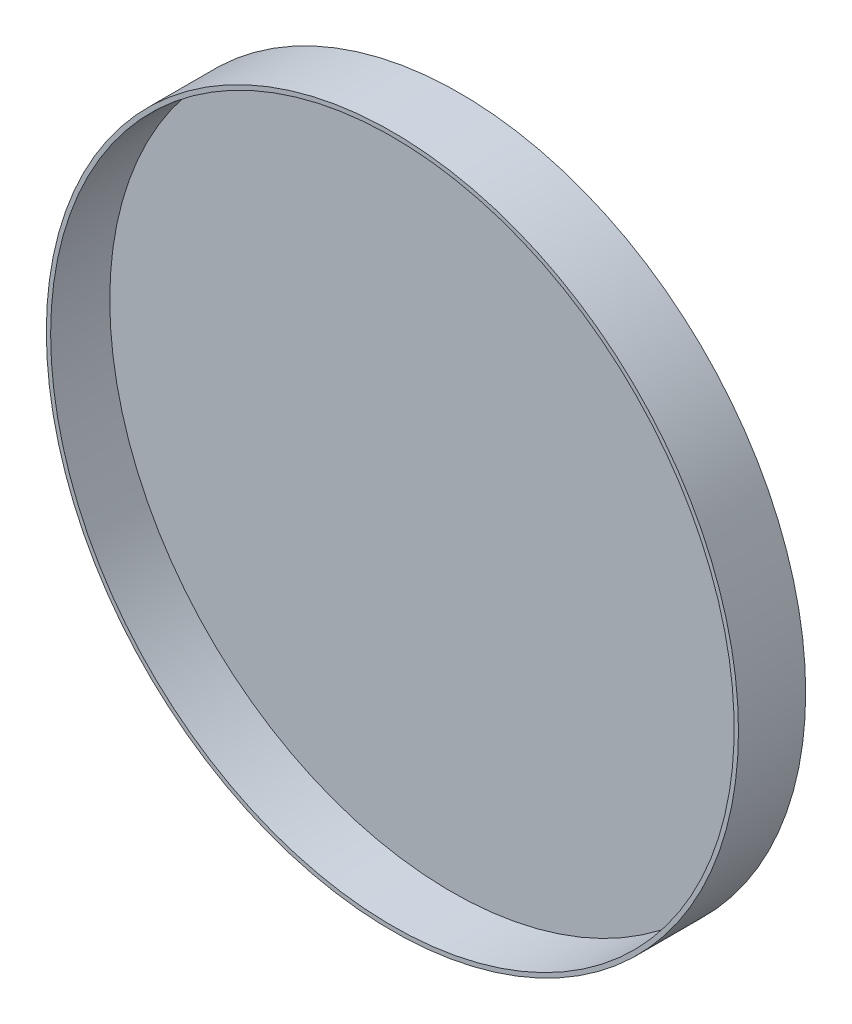
ISO-10303-21;
HEADER;
FILE_DESCRIPTION(('STEP AP214'),'2;1');
FILE_NAME('part.step','',(''),(''),'','','');
FILE_SCHEMA(('AUTOMOTIVE_DESIGN { 1 0 10303 214 1 1 1 1 }'));
ENDSEC;
DATA;
#1=APPLICATION_CONTEXT('core data for automotive mechanical design processes');
#2=APPLICATION_PROTOCOL_DEFINITION('international standard','automotive_design',2000,#1);
#3=PRODUCT_CONTEXT('',#1,'mechanical');
#4=PRODUCT('Part','Part','',(#3));
#5=PRODUCT_RELATED_PRODUCT_CATEGORY('part','',(#4));
#6=PRODUCT_DEFINITION_FORMATION('','',#4);
#7=PRODUCT_DEFINITION_CONTEXT('part definition',#1,'design');
#8=PRODUCT_DEFINITION('design','',#6,#7);
#9=PRODUCT_DEFINITION_SHAPE('','',#8);
#10=(LENGTH_UNIT() NAMED_UNIT(*) SI_UNIT(.MILLI.,.METRE.));
#11=(NAMED_UNIT(*) PLANE_ANGLE_UNIT() SI_UNIT($,.RADIAN.));
#12=(NAMED_UNIT(*) SI_UNIT($,.STERADIAN.) SOLID_ANGLE_UNIT());
#13=UNCERTAINTY_MEASURE_WITH_UNIT(LENGTH_MEASURE(1.E-05),#10,'distance_accuracy_value','');
#14=(GEOMETRIC_REPRESENTATION_CONTEXT(3) GLOBAL_UNCERTAINTY_ASSIGNED_CONTEXT((#13)) GLOBAL_UNIT_ASSIGNED_CONTEXT((#10,
#11,#12)) REPRESENTATION_CONTEXT('',''));
#15=CARTESIAN_POINT('',(0.,0.,0.));
#16=DIRECTION('',(0.,0.,1.));
#17=DIRECTION('',(1.,0.,0.));
#18=AXIS2_PLACEMENT_3D('',#15,#16,#17);
#19=CARTESIAN_POINT('',(0.,0.,0.));
#20=DIRECTION('',(0.,0.,-1.));
#21=DIRECTION('',(-1.,0.,0.));
#22=AXIS2_PLACEMENT_3D('',#19,#20,#21);
#23=PLANE('',#22);
#24=CARTESIAN_POINT('',(0.,0.,0.));
#25=DIRECTION('',(0.,0.,-1.));
#26=DIRECTION('',(-1.,0.,0.));
#27=AXIS2_PLACEMENT_3D('',#24,#25,#26);
#28=CIRCLE('',#27,32.2961);
#29=CARTESIAN_POINT('',(-32.2961,0.,0.));
#30=VERTEX_POINT('',#29);
#31=EDGE_CURVE('E15',#30,#30,#28,.F.);
#32=ORIENTED_EDGE('',*,*,#31,.T.);
#33=EDGE_LOOP('',(#32));
#34=FACE_BOUND('',#33,.T.);
#35=ADVANCED_FACE('F12',(#34),#23,.F.);
#36=CARTESIAN_POINT('',(0.,0.,5.588));
#37=DIRECTION('',(0.,0.,-1.));
#38=DIRECTION('',(-1.,0.,0.));
#39=AXIS2_PLACEMENT_3D('',#36,#37,#38);
#40=CYLINDRICAL_SURFACE('',#39,32.2961);
#41=CARTESIAN_POINT('',(0.,0.,5.588));
#42=DIRECTION('',(0.,0.,-1.));
#43=DIRECTION('',(-1.,0.,0.));
#44=AXIS2_PLACEMENT_3D('',#41,#42,#43);
#45=CIRCLE('',#44,32.2961);
#46=CARTESIAN_POINT('',(-32.2961,0.,5.588));
#47=VERTEX_POINT('',#46);
#48=EDGE_CURVE('E24',#47,#47,#45,.T.);
#49=ORIENTED_EDGE('',*,*,#48,.F.);
#50=EDGE_LOOP('',(#49));
#51=FACE_BOUND('',#50,.T.);
#52=ORIENTED_EDGE('',*,*,#31,.F.);
#53=EDGE_LOOP('',(#52));
#54=FACE_BOUND('',#53,.T.);
#55=ADVANCED_FACE('F33',(#51,#54),#40,.F.);
#56=CARTESIAN_POINT('',(0.,0.,5.588));
#57=DIRECTION('',(0.,0.,1.));
#58=DIRECTION('',(1.,0.,0.));
#59=AXIS2_PLACEMENT_3D('',#56,#57,#58);
#60=PLANE('',#59);
#61=ORIENTED_EDGE('',*,*,#48,.T.);
#62=EDGE_LOOP('',(#61));
#63=FACE_BOUND('',#62,.T.);
#64=CARTESIAN_POINT('',(0.,0.,5.588));
#65=DIRECTION('',(0.,0.,-1.));
#66=DIRECTION('',(-1.,0.,0.));
#67=AXIS2_PLACEMENT_3D('',#64,#65,#66);
#68=CIRCLE('',#67,32.7025);
#69=CARTESIAN_POINT('',(-32.7025,0.,5.588));
#70=VERTEX_POINT('',#69);
#71=EDGE_CURVE('E19',#70,#70,#68,.T.);
#72=ORIENTED_EDGE('',*,*,#71,.F.);
#73=EDGE_LOOP('',(#72));
#74=FACE_BOUND('',#73,.T.);
#75=ADVANCED_FACE('F35',(#63,#74),#60,.T.);
#76=CARTESIAN_POINT('',(0.,0.,5.588));
#77=DIRECTION('',(0.,0.,-1.));
#78=DIRECTION('',(-1.,0.,0.));
#79=AXIS2_PLACEMENT_3D('',#76,#77,#78);
#80=CYLINDRICAL_SURFACE('',#79,32.7025);
#81=ORIENTED_EDGE('',*,*,#71,.T.);
#82=EDGE_LOOP('',(#81));
#83=FACE_BOUND('',#82,.T.);
#84=CARTESIAN_POINT('',(0.,0.,-0.762));
#85=DIRECTION('',(0.,0.,-1.));
#86=DIRECTION('',(-1.,0.,0.));
#87=AXIS2_PLACEMENT_3D('',#84,#85,#86);
#88=CIRCLE('',#87,32.7025);
#89=CARTESIAN_POINT('',(-32.7025,0.,-0.762));
#90=VERTEX_POINT('',#89);
#91=EDGE_CURVE('E8',#90,#90,#88,.T.);
#92=ORIENTED_EDGE('',*,*,#91,.F.);
#93=EDGE_LOOP('',(#92));
#94=FACE_BOUND('',#93,.T.);
#95=ADVANCED_FACE('F42',(#83,#94),#80,.T.);
#96=CARTESIAN_POINT('',(0.,0.,-0.762));
#97=DIRECTION('',(0.,0.,-1.));
#98=DIRECTION('',(-1.,0.,0.));
#99=AXIS2_PLACEMENT_3D('',#96,#97,#98);
#100=PLANE('',#99);
#101=ORIENTED_EDGE('',*,*,#91,.T.);
#102=EDGE_LOOP('',(#101));
#103=FACE_BOUND('',#102,.T.);
#104=ADVANCED_FACE('F45',(#103),#100,.T.);
#105=CLOSED_SHELL('',(#35,#55,#75,#95,#104));
#106=MANIFOLD_SOLID_BREP('B1',#105);
#107=ADVANCED_BREP_SHAPE_REPRESENTATION('',(#18,#106),#14);
#108=SHAPE_DEFINITION_REPRESENTATION(#9,#107);
ENDSEC;
END-ISO-10303-21;
